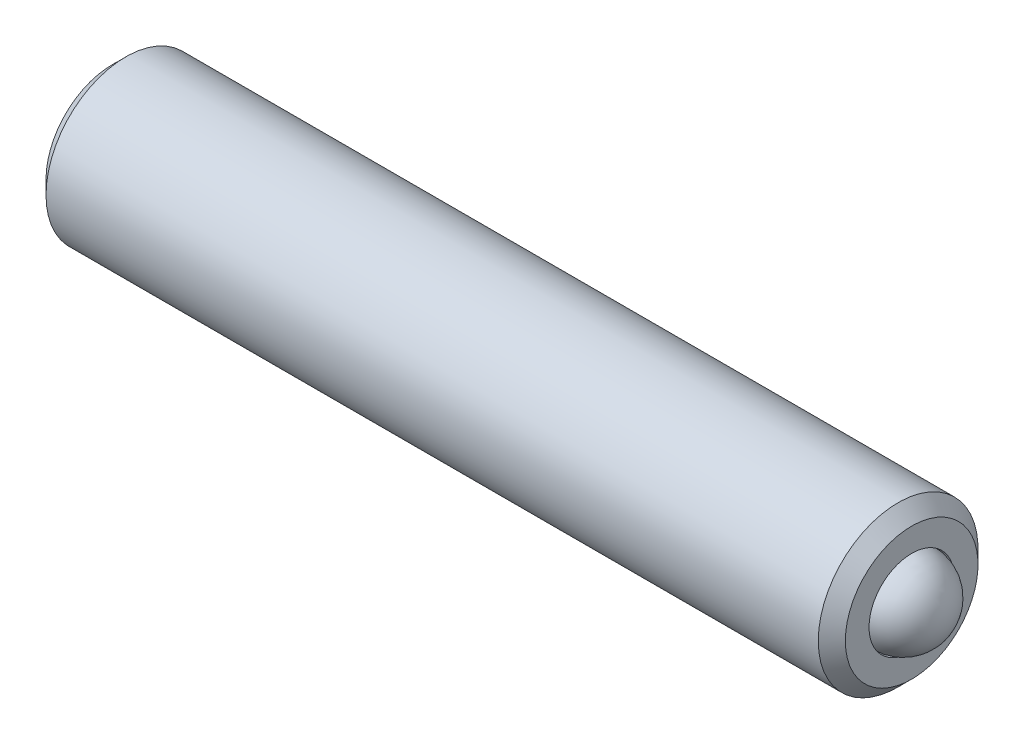
ISO-10303-21;
HEADER;
FILE_DESCRIPTION(('STEP AP214'),'2;1');
FILE_NAME('part.step','',(''),(''),'','','');
FILE_SCHEMA(('AUTOMOTIVE_DESIGN { 1 0 10303 214 1 1 1 1 }'));
ENDSEC;
DATA;
#1=APPLICATION_CONTEXT('core data for automotive mechanical design processes');
#2=APPLICATION_PROTOCOL_DEFINITION('international standard','automotive_design',2000,#1);
#3=PRODUCT_CONTEXT('',#1,'mechanical');
#4=PRODUCT('Part','Part','',(#3));
#5=PRODUCT_RELATED_PRODUCT_CATEGORY('part','',(#4));
#6=PRODUCT_DEFINITION_FORMATION('','',#4);
#7=PRODUCT_DEFINITION_CONTEXT('part definition',#1,'design');
#8=PRODUCT_DEFINITION('design','',#6,#7);
#9=PRODUCT_DEFINITION_SHAPE('','',#8);
#10=(LENGTH_UNIT() NAMED_UNIT(*) SI_UNIT(.MILLI.,.METRE.));
#11=(NAMED_UNIT(*) PLANE_ANGLE_UNIT() SI_UNIT($,.RADIAN.));
#12=(NAMED_UNIT(*) SI_UNIT($,.STERADIAN.) SOLID_ANGLE_UNIT());
#13=UNCERTAINTY_MEASURE_WITH_UNIT(LENGTH_MEASURE(1.E-05),#10,'distance_accuracy_value','');
#14=(GEOMETRIC_REPRESENTATION_CONTEXT(3) GLOBAL_UNCERTAINTY_ASSIGNED_CONTEXT((#13)) GLOBAL_UNIT_ASSIGNED_CONTEXT((#10,
#11,#12)) REPRESENTATION_CONTEXT('',''));
#15=CARTESIAN_POINT('',(0.,0.,0.));
#16=DIRECTION('',(0.,0.,1.));
#17=DIRECTION('',(1.,0.,0.));
#18=AXIS2_PLACEMENT_3D('',#15,#16,#17);
#19=CARTESIAN_POINT('',(-50.8492280408344,6.68988555515205,9.65462218806579));
#20=DIRECTION('',(-1.,0.,0.));
#21=DIRECTION('',(0.,0.,1.));
#22=AXIS2_PLACEMENT_3D('',#19,#20,#21);
#23=PLANE('',#22);
#24=CARTESIAN_POINT('',(-50.8492280408344,19.2129242950614,9.6546221880658));
#25=DIRECTION('',(-1.,0.,0.));
#26=DIRECTION('',(0.,0.,1.));
#27=AXIS2_PLACEMENT_3D('',#24,#25,#26);
#28=CIRCLE('',#27,0.952499999999967);
#29=CARTESIAN_POINT('',(-50.8492280408344,19.2129242950614,10.6071221880658));
#30=VERTEX_POINT('',#29);
#31=EDGE_CURVE('P0_E209',#30,#30,#28,.T.);
#32=ORIENTED_EDGE('',*,*,#31,.F.);
#33=EDGE_LOOP('',(#32));
#34=FACE_BOUND('',#33,.T.);
#35=CARTESIAN_POINT('',(-50.8492280408344,19.2129242950614,9.65462218806579));
#36=DIRECTION('',(-1.,0.,0.));
#37=DIRECTION('',(0.,0.,1.));
#38=AXIS2_PLACEMENT_3D('',#35,#36,#37);
#39=CIRCLE('',#38,1.24460000000001);
#40=CARTESIAN_POINT('',(-50.8492280408344,19.2129242950614,10.8992221880658));
#41=VERTEX_POINT('',#40);
#42=EDGE_CURVE('P0_E102',#41,#41,#39,.T.);
#43=ORIENTED_EDGE('',*,*,#42,.T.);
#44=EDGE_LOOP('',(#43));
#45=FACE_BOUND('',#44,.T.);
#46=ADVANCED_FACE('P0_F17',(#34,#45),#23,.T.);
#47=CARTESIAN_POINT('',(-37.131810055968,19.2129242950614,9.65462218806579));
#48=DIRECTION('',(1.,0.,0.));
#49=DIRECTION('',(0.,0.,-1.));
#50=AXIS2_PLACEMENT_3D('',#47,#48,#49);
#51=CONICAL_SURFACE('',#50,0.,0.785398163397462);
#52=CARTESIAN_POINT('',(-36.331710055968,19.2129242950614,9.65462218806579));
#53=DIRECTION('',(-1.,0.,0.));
#54=DIRECTION('',(0.,0.,1.));
#55=AXIS2_PLACEMENT_3D('',#52,#53,#54);
#56=CIRCLE('',#55,0.800100000000012);
#57=CARTESIAN_POINT('',(-36.331710055968,19.2129242950614,10.4547221880658));
#58=VERTEX_POINT('',#57);
#59=EDGE_CURVE('P0_E29',#58,#58,#56,.T.);
#60=ORIENTED_EDGE('',*,*,#59,.F.);
#61=EDGE_LOOP('',(#60));
#62=FACE_BOUND('',#61,.T.);
#63=CARTESIAN_POINT('',(-37.131810055968,19.2129242950614,9.65462218806579));
#64=VERTEX_POINT('',#63);
#65=VERTEX_LOOP('',#64);
#66=FACE_BOUND('',#65,.T.);
#67=ADVANCED_FACE('P0_F121',(#62,#66),#51,.F.);
#68=CARTESIAN_POINT('',(-50.8492280408344,19.2129242950614,9.65462218806579));
#69=DIRECTION('',(-1.,0.,0.));
#70=DIRECTION('',(0.,0.,1.));
#71=AXIS2_PLACEMENT_3D('',#68,#69,#70);
#72=CYLINDRICAL_SURFACE('',#71,0.800100000000026);
#73=CARTESIAN_POINT('',(-35.8505280408344,19.2129242950614,9.65462218806579));
#74=DIRECTION('',(-1.,0.,0.));
#75=DIRECTION('',(0.,0.,1.));
#76=AXIS2_PLACEMENT_3D('',#73,#74,#75);
#77=CIRCLE('',#76,0.800100000000039);
#78=CARTESIAN_POINT('',(-35.8505280408344,19.2129242950614,10.4547221880658));
#79=VERTEX_POINT('',#78);
#80=EDGE_CURVE('P0_E114',#79,#79,#77,.T.);
#81=ORIENTED_EDGE('',*,*,#80,.F.);
#82=EDGE_LOOP('',(#81));
#83=FACE_BOUND('',#82,.T.);
#84=ORIENTED_EDGE('',*,*,#59,.T.);
#85=EDGE_LOOP('',(#84));
#86=FACE_BOUND('',#85,.T.);
#87=ADVANCED_FACE('P0_F119',(#83,#86),#72,.F.);
#88=CARTESIAN_POINT('',(-35.8505280408344,6.68988555515184,9.65462218806579));
#89=DIRECTION('',(-1.,0.,0.));
#90=DIRECTION('',(0.,0.,1.));
#91=AXIS2_PLACEMENT_3D('',#88,#89,#90);
#92=PLANE('',#91);
#93=CARTESIAN_POINT('',(-35.8505280408343,19.2129242950614,9.65462218806579));
#94=DIRECTION('',(-1.,0.,0.));
#95=DIRECTION('',(0.,0.,1.));
#96=AXIS2_PLACEMENT_3D('',#93,#94,#95);
#97=CIRCLE('',#96,1.24460000000001);
#98=CARTESIAN_POINT('',(-35.8505280408343,19.2129242950614,10.8992221880658));
#99=VERTEX_POINT('',#98);
#100=EDGE_CURVE('P0_E111',#99,#99,#97,.T.);
#101=ORIENTED_EDGE('',*,*,#100,.F.);
#102=EDGE_LOOP('',(#101));
#103=FACE_BOUND('',#102,.T.);
#104=ORIENTED_EDGE('',*,*,#80,.T.);
#105=EDGE_LOOP('',(#104));
#106=FACE_BOUND('',#105,.T.);
#107=ADVANCED_FACE('P0_F128',(#103,#106),#92,.F.);
#108=CARTESIAN_POINT('',(-35.8505280408343,19.2129242950614,9.65462218806579));
#109=DIRECTION('',(-1.,0.,0.));
#110=DIRECTION('',(0.,0.,1.));
#111=AXIS2_PLACEMENT_3D('',#108,#109,#110);
#112=CONICAL_SURFACE('',#111,1.24460000000001,0.785398163397391);
#113=CARTESIAN_POINT('',(-36.1045280408344,19.2129242950614,9.65462218806579));
#114=DIRECTION('',(-1.,0.,0.));
#115=DIRECTION('',(0.,0.,1.));
#116=AXIS2_PLACEMENT_3D('',#113,#114,#115);
#117=CIRCLE('',#116,1.4986);
#118=CARTESIAN_POINT('',(-36.1045280408344,19.2129242950614,11.1532221880658));
#119=VERTEX_POINT('',#118);
#120=EDGE_CURVE('P0_E108',#119,#119,#117,.T.);
#121=ORIENTED_EDGE('',*,*,#120,.F.);
#122=EDGE_LOOP('',(#121));
#123=FACE_BOUND('',#122,.T.);
#124=ORIENTED_EDGE('',*,*,#100,.T.);
#125=EDGE_LOOP('',(#124));
#126=FACE_BOUND('',#125,.T.);
#127=ADVANCED_FACE('P0_F135',(#123,#126),#112,.T.);
#128=CARTESIAN_POINT('',(-50.8492280408344,19.2129242950614,9.65462218806579));
#129=DIRECTION('',(-1.,0.,0.));
#130=DIRECTION('',(0.,0.,1.));
#131=AXIS2_PLACEMENT_3D('',#128,#129,#130);
#132=CYLINDRICAL_SURFACE('',#131,1.4986);
#133=CARTESIAN_POINT('',(-50.5952280408344,19.2129242950614,9.65462218806579));
#134=DIRECTION('',(-1.,0.,0.));
#135=DIRECTION('',(0.,0.,1.));
#136=AXIS2_PLACEMENT_3D('',#133,#134,#135);
#137=CIRCLE('',#136,1.49859999999999);
#138=CARTESIAN_POINT('',(-50.5952280408344,19.2129242950614,11.1532221880658));
#139=VERTEX_POINT('',#138);
#140=EDGE_CURVE('P0_E105',#139,#139,#137,.T.);
#141=ORIENTED_EDGE('',*,*,#140,.F.);
#142=EDGE_LOOP('',(#141));
#143=FACE_BOUND('',#142,.T.);
#144=ORIENTED_EDGE('',*,*,#120,.T.);
#145=EDGE_LOOP('',(#144));
#146=FACE_BOUND('',#145,.T.);
#147=ADVANCED_FACE('P0_F139',(#143,#146),#132,.T.);
#148=CARTESIAN_POINT('',(-50.8492280408344,19.2129242950614,9.65462218806579));
#149=DIRECTION('',(1.,0.,0.));
#150=DIRECTION('',(0.,0.,-1.));
#151=AXIS2_PLACEMENT_3D('',#148,#149,#150);
#152=CONICAL_SURFACE('',#151,1.24460000000001,0.785398163397408);
#153=ORIENTED_EDGE('',*,*,#140,.T.);
#154=EDGE_LOOP('',(#153));
#155=FACE_BOUND('',#154,.T.);
#156=ORIENTED_EDGE('',*,*,#42,.F.);
#157=EDGE_LOOP('',(#156));
#158=FACE_BOUND('',#157,.T.);
#159=ADVANCED_FACE('P0_F143',(#155,#158),#152,.T.);
#160=CARTESIAN_POINT('',(-50.8492280408344,19.2129242950614,9.6546221880658));
#161=DIRECTION('',(-1.,0.,0.));
#162=DIRECTION('',(0.,0.,1.));
#163=AXIS2_PLACEMENT_3D('',#160,#161,#162);
#164=CONICAL_SURFACE('',#163,0.952499999999967,0.78539816339745);
#165=ORIENTED_EDGE('',*,*,#31,.T.);
#166=EDGE_LOOP('',(#165));
#167=FACE_BOUND('',#166,.T.);
#168=CARTESIAN_POINT('',(-50.6461435375757,19.9623397651152,9.6548221880658));
#169=CARTESIAN_POINT('',(-50.6332669544786,19.9494553235606,9.63250568066609));
#170=CARTESIAN_POINT('',(-50.6211450346126,19.9363562535594,9.60981742589206));
#171=CARTESIAN_POINT('',(-50.5989492701165,19.9096454909543,9.56355302795113));
#172=CARTESIAN_POINT('',(-50.5888877875176,19.8960312533826,9.53997247677069));
#173=CARTESIAN_POINT('',(-50.5716542178505,19.8685769960101,9.49242030811735));
#174=CARTESIAN_POINT('',(-50.564438733747,19.85474400778,9.46846086968234));
#175=CARTESIAN_POINT('',(-50.5533125939582,19.8267800777349,9.42002592206498));
#176=CARTESIAN_POINT('',(-50.5493936513459,19.8126499751233,9.39555186642545));
#177=CARTESIAN_POINT('',(-50.5444217062835,19.7781360728176,9.33577203406448));
#178=CARTESIAN_POINT('',(-50.5453212424714,19.75767165652,9.30032662528982));
#179=CARTESIAN_POINT('',(-50.5545897838917,19.717171781506,9.23017878406545));
#180=CARTESIAN_POINT('',(-50.562969943118,19.6971370091074,9.19547754035296));
#181=CARTESIAN_POINT('',(-50.5831790195046,19.6619519543163,9.13453523778766));
#182=CARTESIAN_POINT('',(-50.5939537424295,19.6466399138503,9.10801400573294));
#183=CARTESIAN_POINT('',(-50.6182266563963,19.6166157969289,9.0560107097727));
#184=CARTESIAN_POINT('',(-50.6317159883813,19.6019019513419,9.03052558164131));
#185=CARTESIAN_POINT('',(-50.6461435375757,19.5874588250076,9.00550935301011));
#186=B_SPLINE_CURVE_WITH_KNOTS('',3,(#168,#169,#170,#171,#172,#173,#174,#175,#176,#177,#178,
#179,#180,#181,#182,#183,#184,#185),.UNSPECIFIED.,.F.,.F.,(4,2,2,2,2,2,2,2,4),(0.,
0.0864788641253363,0.173462284806168,0.259062693136961,0.344447268473232,0.466486555643646,
0.588708114182827,0.68596269286373,0.78290488582614),.UNSPECIFIED.);
#187=CARTESIAN_POINT('',(-50.6460280408344,19.9622242950614,9.6546221880658));
#188=VERTEX_POINT('',#187);
#189=CARTESIAN_POINT('',(-50.6460280408344,19.5875742950614,9.00570935301011));
#190=VERTEX_POINT('',#189);
#191=EDGE_CURVE('P0_E86',#188,#190,#186,.T.);
#192=ORIENTED_EDGE('',*,*,#191,.F.);
#193=CARTESIAN_POINT('',(-50.6461435375757,19.9623397651152,9.6544221880658));
#194=CARTESIAN_POINT('',(-50.6332669544786,19.9494553235606,9.67673869546551));
#195=CARTESIAN_POINT('',(-50.6211450346126,19.9363562535594,9.69942695023954));
#196=CARTESIAN_POINT('',(-50.5989492701165,19.9096454909543,9.74569134818047));
#197=CARTESIAN_POINT('',(-50.5888877875176,19.8960312533826,9.76927189936091));
#198=CARTESIAN_POINT('',(-50.5716542178505,19.8685769960101,9.81682406801425));
#199=CARTESIAN_POINT('',(-50.564438733747,19.85474400778,9.84078350644925));
#200=CARTESIAN_POINT('',(-50.5533125939582,19.8267800777349,9.88921845406662));
#201=CARTESIAN_POINT('',(-50.5493936513459,19.8126499751233,9.91369250970615));
#202=CARTESIAN_POINT('',(-50.5444217062835,19.7781360728176,9.97347234206712));
#203=CARTESIAN_POINT('',(-50.5453212424714,19.75767165652,10.0089177508418));
#204=CARTESIAN_POINT('',(-50.5545897838917,19.717171781506,10.0790655920662));
#205=CARTESIAN_POINT('',(-50.562969943118,19.6971370091074,10.1137668357786));
#206=CARTESIAN_POINT('',(-50.5831790195046,19.6619519543163,10.1747091383439));
#207=CARTESIAN_POINT('',(-50.5939537424295,19.6466399138503,10.2012303703986));
#208=CARTESIAN_POINT('',(-50.6182266563963,19.6166157969289,10.2532336663589));
#209=CARTESIAN_POINT('',(-50.6317159883813,19.6019019513419,10.2787187944903));
#210=CARTESIAN_POINT('',(-50.6461435375757,19.5874588250076,10.3037350231215));
#211=B_SPLINE_CURVE_WITH_KNOTS('',3,(#193,#194,#195,#196,#197,#198,#199,#200,#201,#202,#203,
#204,#205,#206,#207,#208,#209,#210),.UNSPECIFIED.,.F.,.F.,(4,2,2,2,2,2,2,2,4),(0.,
0.0864788641253363,0.173462284806164,0.259062693136952,0.344447268473231,0.466486555643645,
0.588708114182826,0.685962692863699,0.782904885826084),.UNSPECIFIED.);
#212=CARTESIAN_POINT('',(-50.6460280408344,19.5875742950614,10.3035350231215));
#213=VERTEX_POINT('',#212);
#214=EDGE_CURVE('P0_E185',#188,#213,#211,.T.);
#215=ORIENTED_EDGE('',*,*,#214,.T.);
#216=CARTESIAN_POINT('',(-52.3582672597763,16.8384585743382,10.3035350231214));
#217=CARTESIAN_POINT('',(-52.3005248184635,16.8983236608722,10.3035350231214));
#218=CARTESIAN_POINT('',(-52.2428558846747,16.9582599817461,10.3035350231214));
#219=CARTESIAN_POINT('',(-52.1277140621493,17.0783267267323,10.3035350231214));
#220=CARTESIAN_POINT('',(-52.0702411840464,17.1384571610392,10.3035350231214));
#221=CARTESIAN_POINT('',(-51.9553874274638,17.2591246989136,10.3035350231214));
#222=CARTESIAN_POINT('',(-51.8980072476852,17.3196624680924,10.3035350231214));
#223=CARTESIAN_POINT('',(-51.7835818929589,17.4410493968345,10.3035350231214));
#224=CARTESIAN_POINT('',(-51.7265367043378,17.5018985434956,10.3035350231214));
#225=CARTESIAN_POINT('',(-51.6057517318865,17.6316876956167,10.3035350231214));
#226=CARTESIAN_POINT('',(-51.5420716794448,17.70068336987,10.3035350231214));
#227=CARTESIAN_POINT('',(-51.415524266655,17.8394366097933,10.3035350231214));
#228=CARTESIAN_POINT('',(-51.3526570190744,17.9091942787562,10.3035350231214));
#229=CARTESIAN_POINT('',(-51.2282956128797,18.049715814669,10.3035350231214));
#230=CARTESIAN_POINT('',(-51.1667993188585,18.1204777878539,10.3035350231214));
#231=CARTESIAN_POINT('',(-51.0458742541531,18.2637386653362,10.3035350231214));
#232=CARTESIAN_POINT('',(-50.9864448576677,18.3362370324737,10.3035350231214));
#233=CARTESIAN_POINT('',(-50.8941427467821,18.4549489858022,10.3035350231214));
#234=CARTESIAN_POINT('',(-50.8600628807907,18.5002179064351,10.3035350231214));
#235=CARTESIAN_POINT('',(-50.793993741084,18.5924079199968,10.3035350231214));
#236=CARTESIAN_POINT('',(-50.7620084081889,18.6393318854079,10.3035350231214));
#237=CARTESIAN_POINT('',(-50.7021553148581,18.734417449365,10.3035350231214));
#238=CARTESIAN_POINT('',(-50.6742159663038,18.7825332543751,10.3035350231214));
#239=CARTESIAN_POINT('',(-50.6240791803403,18.88161381957,10.3035350231214));
#240=CARTESIAN_POINT('',(-50.6018597073632,18.9325666978299,10.3035350231214));
#241=CARTESIAN_POINT('',(-50.5737664350338,19.0174446302383,10.3035350231214));
#242=CARTESIAN_POINT('',(-50.5648938568847,19.0503495839798,10.3035350231214));
#243=CARTESIAN_POINT('',(-50.5518762581693,19.1170254606582,10.3035350231214));
#244=CARTESIAN_POINT('',(-50.5477183138756,19.150793755564,10.3035350231214));
#245=CARTESIAN_POINT('',(-50.5444624635168,19.226203247837,10.3035350231214));
#246=CARTESIAN_POINT('',(-50.5467090548792,19.2679110777235,10.3035350231214));
#247=CARTESIAN_POINT('',(-50.5587549291686,19.3503263367743,10.3035350231214));
#248=CARTESIAN_POINT('',(-50.5685873595642,19.3910285641315,10.3035350231214));
#249=CARTESIAN_POINT('',(-50.5912818196157,19.4623603771279,10.3035350231214));
#250=CARTESIAN_POINT('',(-50.6031052209592,19.4933402533904,10.3035350231214));
#251=CARTESIAN_POINT('',(-50.6293857296264,19.5541753585139,10.3035350231214));
#252=CARTESIAN_POINT('',(-50.6438450054584,19.5840296367694,10.3035350231214));
#253=CARTESIAN_POINT('',(-50.674821082072,19.6430144114392,10.3035350231215));
#254=CARTESIAN_POINT('',(-50.6913569889331,19.6721347019612,10.3035350231215));
#255=CARTESIAN_POINT('',(-50.725835053014,19.7295043368302,10.3035350231215));
#256=CARTESIAN_POINT('',(-50.7437765881965,19.7577540588069,10.3035350231215));
#257=CARTESIAN_POINT('',(-50.7856302604539,19.8210063289774,10.3035350231215));
#258=CARTESIAN_POINT('',(-50.8098578928856,19.8557988616734,10.3035350231215));
#259=CARTESIAN_POINT('',(-50.8594933521178,19.924535310787,10.3035350231215));
#260=CARTESIAN_POINT('',(-50.8849014445484,19.958479033534,10.3035350231215));
#261=CARTESIAN_POINT('',(-50.9624264420727,20.0593879807787,10.3035350231215));
#262=CARTESIAN_POINT('',(-51.0158076126297,20.1253782669672,10.3035350231215));
#263=CARTESIAN_POINT('',(-51.1246440881747,20.2559847894286,10.3035350231215));
#264=CARTESIAN_POINT('',(-51.1801059031482,20.3205955109384,10.3035350231215));
#265=CARTESIAN_POINT('',(-51.2922045642701,20.4487353923309,10.3035350231215));
#266=CARTESIAN_POINT('',(-51.3488408644773,20.5122650307978,10.3035350231215));
#267=CARTESIAN_POINT('',(-51.4565972583726,20.6316149197107,10.3035350231215));
#268=CARTESIAN_POINT('',(-51.5076343575766,20.6875104474987,10.3035350231215));
#269=CARTESIAN_POINT('',(-51.6101732899424,20.7988874174632,10.3035350231215));
#270=CARTESIAN_POINT('',(-51.6616751858445,20.8543688018325,10.3035350231215));
#271=CARTESIAN_POINT('',(-51.7646749123315,20.9646446043097,10.3035350231215));
#272=CARTESIAN_POINT('',(-51.816170483131,21.0194411365141,10.3035350231215));
#273=CARTESIAN_POINT('',(-51.9194156065366,21.1287773349842,10.3035350231215));
#274=CARTESIAN_POINT('',(-51.9711651156316,21.1833170423189,10.3035350231215));
#275=CARTESIAN_POINT('',(-52.0230092694508,21.2377660162008,10.3035350231215));
#276=B_SPLINE_CURVE_WITH_KNOTS('',3,(#216,#217,#218,#219,#220,#221,#222,#223,#224,#225,#226,
#227,#228,#229,#230,#231,#232,#233,#234,#235,#236,#237,#238,#239,#240,#241,#242,#243,#244,#245,
#246,#247,#248,#249,#250,#251,#252,#253,#254,#255,#256,#257,#258,#259,#260,#261,#262,#263,#264,
#265,#266,#267,#268,#269,#270,#271,#272,#273,#274,#275),.UNSPECIFIED.,.F.,.F.,(4,2,2,2,2,2,2,2,
2,2,2,2,2,2,2,2,2,2,2,2,2,2,2,2,2,2,2,2,2,4),(0.,0.249524169444004,0.499061664048885,
0.749292126030595,0.999512302282445,1.28118188446101,1.56289013456249,1.84412364646024,
2.12527125365798,2.29522422452389,2.46548827885776,2.63222422359155,2.79830787351782,
2.90027530295199,3.00196253895402,3.12646325295113,3.25151109444012,3.3508471107282,
3.45026522165705,3.55067620712116,3.65104300569414,3.77819720424592,3.90538015527483,
4.15993807573804,4.41537266799765,4.67069107504104,4.89776066228875,5.12486137303339,
5.35044877312651,5.57599878315942),.UNSPECIFIED.);
#277=CARTESIAN_POINT('',(-50.6460280408344,18.8382742950614,10.3035350231214));
#278=VERTEX_POINT('',#277);
#279=EDGE_CURVE('P0_E180',#213,#278,#276,.F.);
#280=ORIENTED_EDGE('',*,*,#279,.T.);
#281=CARTESIAN_POINT('',(-50.6461435375757,18.8383897651152,10.3037350231214));
#282=CARTESIAN_POINT('',(-50.6332669544785,18.8255053235606,10.2814185157217));
#283=CARTESIAN_POINT('',(-50.6211450346126,18.8124062535594,10.2587302609477));
#284=CARTESIAN_POINT('',(-50.5989492701165,18.7856954909543,10.2124658630068));
#285=CARTESIAN_POINT('',(-50.5888877875175,18.7720812533826,10.1888853118263));
#286=CARTESIAN_POINT('',(-50.5716542178505,18.7446269960101,10.141333143173));
#287=CARTESIAN_POINT('',(-50.564438733747,18.73079400778,10.117373704738));
#288=CARTESIAN_POINT('',(-50.5533125939582,18.7028300777349,10.0689387571206));
#289=CARTESIAN_POINT('',(-50.5493936513459,18.6886999751233,10.0444647014811));
#290=CARTESIAN_POINT('',(-50.5444217062835,18.6541860728176,9.98468486912015));
#291=CARTESIAN_POINT('',(-50.5453212424714,18.63372165652,9.94923946034549));
#292=CARTESIAN_POINT('',(-50.5545897838917,18.593221781506,9.87909161912112));
#293=CARTESIAN_POINT('',(-50.562969943118,18.5731870091074,9.84439037540864));
#294=CARTESIAN_POINT('',(-50.5831790195046,18.5380019543163,9.78344807284333));
#295=CARTESIAN_POINT('',(-50.5939537424295,18.5226899138503,9.75692684078862));
#296=CARTESIAN_POINT('',(-50.6182266563963,18.4926657969289,9.70492354482838));
#297=CARTESIAN_POINT('',(-50.6317159883813,18.4779519513419,9.67943841669699));
#298=CARTESIAN_POINT('',(-50.6461435375757,18.4635088250075,9.65442218806579));
#299=B_SPLINE_CURVE_WITH_KNOTS('',3,(#281,#282,#283,#284,#285,#286,#287,#288,#289,#290,#291,
#292,#293,#294,#295,#296,#297,#298),.UNSPECIFIED.,.F.,.F.,(4,2,2,2,2,2,2,2,4),(0.,
0.0864788641253178,0.173462284806133,0.259062693136907,0.344447268473169,0.466486555643585,
0.588708114182759,0.685962692863657,0.782904885826072),.UNSPECIFIED.);
#300=CARTESIAN_POINT('',(-50.6460280408344,18.4636242950614,9.65462218806579));
#301=VERTEX_POINT('',#300);
#302=EDGE_CURVE('P0_E36',#278,#301,#299,.T.);
#303=ORIENTED_EDGE('',*,*,#302,.T.);
#304=CARTESIAN_POINT('',(-50.6461435375757,18.8383897651152,9.00550935301011));
#305=CARTESIAN_POINT('',(-50.6332669544786,18.8255053235606,9.02782586040982));
#306=CARTESIAN_POINT('',(-50.6211450346126,18.8124062535594,9.05051411518386));
#307=CARTESIAN_POINT('',(-50.5989492701166,18.7856954909543,9.09677851312478));
#308=CARTESIAN_POINT('',(-50.5888877875176,18.7720812533826,9.12035906430522));
#309=CARTESIAN_POINT('',(-50.5716542178505,18.7446269960101,9.16791123295856));
#310=CARTESIAN_POINT('',(-50.564438733747,18.73079400778,9.19187067139356));
#311=CARTESIAN_POINT('',(-50.5533125939582,18.7028300777349,9.24030561901093));
#312=CARTESIAN_POINT('',(-50.5493936513459,18.6886999751233,9.26477967465046));
#313=CARTESIAN_POINT('',(-50.5444217062835,18.6541860728176,9.32455950701143));
#314=CARTESIAN_POINT('',(-50.5453212424714,18.63372165652,9.36000491578609));
#315=CARTESIAN_POINT('',(-50.5545897838917,18.593221781506,9.43015275701046));
#316=CARTESIAN_POINT('',(-50.562969943118,18.5731870091074,9.46485400072295));
#317=CARTESIAN_POINT('',(-50.5831790195046,18.5380019543163,9.52579630328825));
#318=CARTESIAN_POINT('',(-50.5939537424295,18.5226899138503,9.55231753534296));
#319=CARTESIAN_POINT('',(-50.6182266563963,18.4926657969289,9.6043208313032));
#320=CARTESIAN_POINT('',(-50.6317159883813,18.4779519513419,9.62980595943459));
#321=CARTESIAN_POINT('',(-50.6461435375757,18.4635088250075,9.65482218806579));
#322=B_SPLINE_CURVE_WITH_KNOTS('',3,(#304,#305,#306,#307,#308,#309,#310,#311,#312,#313,#314,
#315,#316,#317,#318,#319,#320,#321),.UNSPECIFIED.,.F.,.F.,(4,2,2,2,2,2,2,2,4),(0.,
0.086478864125342,0.173462284806171,0.259062693136955,0.344447268473237,0.466486555643653,
0.588708114182834,0.685962692863721,0.782904885826126),.UNSPECIFIED.);
#323=CARTESIAN_POINT('',(-50.6460280408344,18.8382742950614,9.00570935301011));
#324=VERTEX_POINT('',#323);
#325=EDGE_CURVE('P0_E11',#324,#301,#322,.T.);
#326=ORIENTED_EDGE('',*,*,#325,.F.);
#327=CARTESIAN_POINT('',(-52.3582672597763,16.8384585743382,9.00570935301011));
#328=CARTESIAN_POINT('',(-52.3005248184635,16.8983236608722,9.00570935301011));
#329=CARTESIAN_POINT('',(-52.2428558846747,16.9582599817461,9.00570935301011));
#330=CARTESIAN_POINT('',(-52.1277140621493,17.0783267267324,9.00570935301011));
#331=CARTESIAN_POINT('',(-52.0702411840464,17.1384571610392,9.00570935301011));
#332=CARTESIAN_POINT('',(-51.9553874274638,17.2591246989136,9.00570935301011));
#333=CARTESIAN_POINT('',(-51.8980072476852,17.3196624680925,9.00570935301011));
#334=CARTESIAN_POINT('',(-51.7835818929589,17.4410493968345,9.00570935301011));
#335=CARTESIAN_POINT('',(-51.7265367043378,17.5018985434956,9.00570935301011));
#336=CARTESIAN_POINT('',(-51.6057517318866,17.6316876956167,9.00570935301011));
#337=CARTESIAN_POINT('',(-51.5420716794448,17.70068336987,9.00570935301011));
#338=CARTESIAN_POINT('',(-51.415524266655,17.8394366097932,9.00570935301011));
#339=CARTESIAN_POINT('',(-51.3526570190745,17.9091942787562,9.00570935301011));
#340=CARTESIAN_POINT('',(-51.2282956128798,18.0497158146689,9.00570935301011));
#341=CARTESIAN_POINT('',(-51.1667993188586,18.1204777878538,9.00570935301011));
#342=CARTESIAN_POINT('',(-51.0458742541532,18.2637386653361,9.00570935301011));
#343=CARTESIAN_POINT('',(-50.9864448576678,18.3362370324736,9.00570935301011));
#344=CARTESIAN_POINT('',(-50.8941427467822,18.4549489858021,9.00570935301011));
#345=CARTESIAN_POINT('',(-50.8600628807908,18.5002179064351,9.00570935301011));
#346=CARTESIAN_POINT('',(-50.793993741084,18.5924079199967,9.00570935301011));
#347=CARTESIAN_POINT('',(-50.7620084081889,18.6393318854079,9.00570935301011));
#348=CARTESIAN_POINT('',(-50.7021553148582,18.734417449365,9.00570935301011));
#349=CARTESIAN_POINT('',(-50.6742159663039,18.7825332543751,9.00570935301011));
#350=CARTESIAN_POINT('',(-50.6240791803404,18.88161381957,9.00570935301011));
#351=CARTESIAN_POINT('',(-50.6018597073633,18.9325666978299,9.00570935301011));
#352=CARTESIAN_POINT('',(-50.5737664350339,19.0174446302384,9.00570935301011));
#353=CARTESIAN_POINT('',(-50.5648938568848,19.0503495839798,9.00570935301011));
#354=CARTESIAN_POINT('',(-50.5518762581694,19.1170254606582,9.00570935301011));
#355=CARTESIAN_POINT('',(-50.5477183138756,19.150793755564,9.00570935301011));
#356=CARTESIAN_POINT('',(-50.5444624635169,19.226203247837,9.00570935301011));
#357=CARTESIAN_POINT('',(-50.5467090548793,19.2679110777235,9.00570935301011));
#358=CARTESIAN_POINT('',(-50.5587549291687,19.3503263367743,9.00570935301011));
#359=CARTESIAN_POINT('',(-50.5685873595643,19.3910285641315,9.00570935301011));
#360=CARTESIAN_POINT('',(-50.5912818196158,19.462360377128,9.00570935301011));
#361=CARTESIAN_POINT('',(-50.6031052209593,19.4933402533904,9.00570935301011));
#362=CARTESIAN_POINT('',(-50.6293857296265,19.554175358514,9.00570935301011));
#363=CARTESIAN_POINT('',(-50.6438450054585,19.5840296367695,9.00570935301011));
#364=CARTESIAN_POINT('',(-50.6748210820721,19.6430144114393,9.00570935301011));
#365=CARTESIAN_POINT('',(-50.6913569889332,19.6721347019613,9.00570935301011));
#366=CARTESIAN_POINT('',(-50.725835053014,19.7295043368303,9.00570935301011));
#367=CARTESIAN_POINT('',(-50.7437765881966,19.757754058807,9.00570935301011));
#368=CARTESIAN_POINT('',(-50.785630260454,19.8210063289775,9.00570935301011));
#369=CARTESIAN_POINT('',(-50.8098578928857,19.8557988616735,9.00570935301011));
#370=CARTESIAN_POINT('',(-50.8594933521179,19.9245353107871,9.00570935301011));
#371=CARTESIAN_POINT('',(-50.8849014445485,19.9584790335341,9.00570935301011));
#372=CARTESIAN_POINT('',(-50.9624264420728,20.0593879807788,9.00570935301011));
#373=CARTESIAN_POINT('',(-51.0158076126298,20.1253782669673,9.00570935301011));
#374=CARTESIAN_POINT('',(-51.1246440881748,20.2559847894288,9.00570935301011));
#375=CARTESIAN_POINT('',(-51.1801059031483,20.3205955109386,9.00570935301011));
#376=CARTESIAN_POINT('',(-51.2922045642702,20.4487353923311,9.00570935301011));
#377=CARTESIAN_POINT('',(-51.3488408644775,20.512265030798,9.00570935301011));
#378=CARTESIAN_POINT('',(-51.4565972583728,20.6316149197109,9.00570935301011));
#379=CARTESIAN_POINT('',(-51.5076343575768,20.6875104474989,9.00570935301011));
#380=CARTESIAN_POINT('',(-51.6101732899426,20.7988874174634,9.00570935301011));
#381=CARTESIAN_POINT('',(-51.6616751858448,20.8543688018327,9.00570935301011));
#382=CARTESIAN_POINT('',(-51.7646749123317,20.96464460431,9.00570935301011));
#383=CARTESIAN_POINT('',(-51.8161704831313,21.0194411365144,9.00570935301011));
#384=CARTESIAN_POINT('',(-51.9194156065368,21.1287773349845,9.00570935301011));
#385=CARTESIAN_POINT('',(-51.9711651156318,21.1833170423192,9.00570935301011));
#386=CARTESIAN_POINT('',(-52.0230092694511,21.2377660162011,9.00570935301011));
#387=B_SPLINE_CURVE_WITH_KNOTS('',3,(#327,#328,#329,#330,#331,#332,#333,#334,#335,#336,#337,
#338,#339,#340,#341,#342,#343,#344,#345,#346,#347,#348,#349,#350,#351,#352,#353,#354,#355,#356,
#357,#358,#359,#360,#361,#362,#363,#364,#365,#366,#367,#368,#369,#370,#371,#372,#373,#374,#375,
#376,#377,#378,#379,#380,#381,#382,#383,#384,#385,#386),.UNSPECIFIED.,.F.,.F.,(4,2,2,2,2,2,2,2,
2,2,2,2,2,2,2,2,2,2,2,2,2,2,2,2,2,2,2,2,2,4),(0.,0.249524169443994,0.499061664048865,
0.749292126030566,0.999512302282406,1.28118188446095,1.5628901345624,1.84412364646013,
2.12527125365785,2.29522422452379,2.46548827885769,2.63222422359149,2.79830787351779,
2.90027530295197,3.001962538954,3.12646325295112,3.25151109444011,3.3508471107282,
3.45026522165707,3.55067620712118,3.65104300569419,3.77819720424598,3.90538015527491,
4.15993807573815,4.4153726679978,4.67069107504122,4.89776066228896,5.12486137303364,
5.35044877312679,5.57599878315973),.UNSPECIFIED.);
#388=EDGE_CURVE('P0_E72',#190,#324,#387,.F.);
#389=ORIENTED_EDGE('',*,*,#388,.F.);
#390=EDGE_LOOP('',(#192,#215,#280,#303,#326,#389));
#391=FACE_BOUND('',#390,.T.);
#392=ADVANCED_FACE('P0_F71',(#167,#391),#164,.F.);
#393=CARTESIAN_POINT('',(-47.8012280408344,16.333382938824,9.65462218806579));
#394=DIRECTION('',(-1.,0.,0.));
#395=DIRECTION('',(0.,0.,1.));
#396=AXIS2_PLACEMENT_3D('',#393,#394,#395);
#397=PLANE('',#396);
#398=DIRECTION('',(0.,-1.,0.));
#399=VECTOR('',#398,1.);
#400=CARTESIAN_POINT('',(-47.8012280408344,16.333382938824,9.00570935301011));
#401=LINE('',#400,#399);
#402=CARTESIAN_POINT('',(-47.8012280408344,19.5875742950614,9.00570935301011));
#403=VERTEX_POINT('',#402);
#404=CARTESIAN_POINT('',(-47.8012280408344,18.8382742950614,9.00570935301011));
#405=VERTEX_POINT('',#404);
#406=EDGE_CURVE('P0_E85',#403,#405,#401,.T.);
#407=ORIENTED_EDGE('',*,*,#406,.T.);
#408=DIRECTION('',(0.,-0.5,0.866025403784439));
#409=VECTOR('',#408,1.);
#410=CARTESIAN_POINT('',(-47.8012280408344,17.931063956002,10.5770437534127));
#411=LINE('',#410,#409);
#412=CARTESIAN_POINT('',(-47.8012280408344,18.4636242950614,9.65462218806579));
#413=VERTEX_POINT('',#412);
#414=EDGE_CURVE('P0_E90',#405,#413,#411,.T.);
#415=ORIENTED_EDGE('',*,*,#414,.T.);
#416=DIRECTION('',(0.,-0.5,-0.866025403784439));
#417=VECTOR('',#416,1.);
#418=CARTESIAN_POINT('',(-47.8012280408344,17.931063956002,8.73220062271891));
#419=LINE('',#418,#417);
#420=CARTESIAN_POINT('',(-47.8012280408344,18.8382742950614,10.3035350231214));
#421=VERTEX_POINT('',#420);
#422=EDGE_CURVE('P0_E224',#421,#413,#419,.T.);
#423=ORIENTED_EDGE('',*,*,#422,.F.);
#424=DIRECTION('',(0.,-1.,0.));
#425=VECTOR('',#424,1.);
#426=CARTESIAN_POINT('',(-47.8012280408344,16.333382938824,10.3035350231213));
#427=LINE('',#426,#425);
#428=CARTESIAN_POINT('',(-47.8012280408344,19.5875742950614,10.3035350231215));
#429=VERTEX_POINT('',#428);
#430=EDGE_CURVE('P0_E214',#429,#421,#427,.T.);
#431=ORIENTED_EDGE('',*,*,#430,.F.);
#432=DIRECTION('',(0.,-0.499999999999998,0.86602540378444));
#433=VECTOR('',#432,1.);
#434=CARTESIAN_POINT('',(-47.8012280408344,19.0550139560021,11.2259565884683));
#435=LINE('',#434,#433);
#436=CARTESIAN_POINT('',(-47.8012280408344,19.9622242950614,9.6546221880658));
#437=VERTEX_POINT('',#436);
#438=EDGE_CURVE('P0_E98',#437,#429,#435,.T.);
#439=ORIENTED_EDGE('',*,*,#438,.F.);
#440=DIRECTION('',(0.,-0.499999999999997,-0.866025403784441));
#441=VECTOR('',#440,1.);
#442=CARTESIAN_POINT('',(-47.8012280408344,19.0550139560021,8.08328778766324));
#443=LINE('',#442,#441);
#444=EDGE_CURVE('P0_E93',#437,#403,#443,.T.);
#445=ORIENTED_EDGE('',*,*,#444,.T.);
#446=EDGE_LOOP('',(#407,#415,#423,#431,#439,#445));
#447=FACE_BOUND('',#446,.T.);
#448=ADVANCED_FACE('P0_F167',(#447),#397,.T.);
#449=CARTESIAN_POINT('',(-47.8012280408344,17.931063956002,10.5770437534127));
#450=DIRECTION('',(0.,-0.866025403784439,-0.5));
#451=DIRECTION('',(0.,0.5,-0.866025403784439));
#452=AXIS2_PLACEMENT_3D('',#449,#450,#451);
#453=PLANE('',#452);
#454=DIRECTION('',(-1.,0.,0.));
#455=VECTOR('',#454,1.);
#456=CARTESIAN_POINT('',(-47.8012280408344,18.8382742950614,9.00570935301011));
#457=LINE('',#456,#455);
#458=EDGE_CURVE('P0_E82',#405,#324,#457,.T.);
#459=ORIENTED_EDGE('',*,*,#458,.T.);
#460=ORIENTED_EDGE('',*,*,#325,.T.);
#461=DIRECTION('',(-1.,0.,0.));
#462=VECTOR('',#461,1.);
#463=CARTESIAN_POINT('',(-47.8012280408344,18.4636242950614,9.65462218806579));
#464=LINE('',#463,#462);
#465=EDGE_CURVE('P0_E92',#413,#301,#464,.T.);
#466=ORIENTED_EDGE('',*,*,#465,.F.);
#467=ORIENTED_EDGE('',*,*,#414,.F.);
#468=EDGE_LOOP('',(#459,#460,#466,#467));
#469=FACE_BOUND('',#468,.T.);
#470=ADVANCED_FACE('P0_F88',(#469),#453,.F.);
#471=CARTESIAN_POINT('',(-47.8012280408344,17.931063956002,8.73220062271891));
#472=DIRECTION('',(0.,0.866025403784439,-0.5));
#473=DIRECTION('',(0.,0.5,0.866025403784439));
#474=AXIS2_PLACEMENT_3D('',#471,#472,#473);
#475=PLANE('',#474);
#476=ORIENTED_EDGE('',*,*,#302,.F.);
#477=DIRECTION('',(-1.,0.,0.));
#478=VECTOR('',#477,1.);
#479=CARTESIAN_POINT('',(-47.8012280408344,18.8382742950614,10.3035350231214));
#480=LINE('',#479,#478);
#481=EDGE_CURVE('P0_E95',#421,#278,#480,.T.);
#482=ORIENTED_EDGE('',*,*,#481,.F.);
#483=ORIENTED_EDGE('',*,*,#422,.T.);
#484=ORIENTED_EDGE('',*,*,#465,.T.);
#485=EDGE_LOOP('',(#476,#482,#483,#484));
#486=FACE_BOUND('',#485,.T.);
#487=ADVANCED_FACE('P0_F198',(#486),#475,.T.);
#488=CARTESIAN_POINT('',(-47.8012280408344,16.333382938824,10.3035350231213));
#489=DIRECTION('',(0.,0.,-1.));
#490=DIRECTION('',(0.,1.,0.));
#491=AXIS2_PLACEMENT_3D('',#488,#489,#490);
#492=PLANE('',#491);
#493=ORIENTED_EDGE('',*,*,#279,.F.);
#494=DIRECTION('',(-1.,0.,0.));
#495=VECTOR('',#494,1.);
#496=CARTESIAN_POINT('',(-47.8012280408344,19.5875742950614,10.3035350231215));
#497=LINE('',#496,#495);
#498=EDGE_CURVE('P0_E215',#429,#213,#497,.T.);
#499=ORIENTED_EDGE('',*,*,#498,.F.);
#500=ORIENTED_EDGE('',*,*,#430,.T.);
#501=ORIENTED_EDGE('',*,*,#481,.T.);
#502=EDGE_LOOP('',(#493,#499,#500,#501));
#503=FACE_BOUND('',#502,.T.);
#504=ADVANCED_FACE('P0_F193',(#503),#492,.T.);
#505=CARTESIAN_POINT('',(-47.8012280408344,19.0550139560021,11.2259565884683));
#506=DIRECTION('',(0.,-0.86602540378444,-0.499999999999998));
#507=DIRECTION('',(0.,0.499999999999998,-0.86602540378444));
#508=AXIS2_PLACEMENT_3D('',#505,#506,#507);
#509=PLANE('',#508);
#510=ORIENTED_EDGE('',*,*,#214,.F.);
#511=DIRECTION('',(-1.,0.,0.));
#512=VECTOR('',#511,1.);
#513=CARTESIAN_POINT('',(-47.8012280408344,19.9622242950614,9.6546221880658));
#514=LINE('',#513,#512);
#515=EDGE_CURVE('P0_E216',#437,#188,#514,.T.);
#516=ORIENTED_EDGE('',*,*,#515,.F.);
#517=ORIENTED_EDGE('',*,*,#438,.T.);
#518=ORIENTED_EDGE('',*,*,#498,.T.);
#519=EDGE_LOOP('',(#510,#516,#517,#518));
#520=FACE_BOUND('',#519,.T.);
#521=ADVANCED_FACE('P0_F190',(#520),#509,.T.);
#522=CARTESIAN_POINT('',(-47.8012280408344,19.0550139560021,8.08328778766324));
#523=DIRECTION('',(0.,0.866025403784441,-0.499999999999997));
#524=DIRECTION('',(0.,0.499999999999997,0.866025403784441));
#525=AXIS2_PLACEMENT_3D('',#522,#523,#524);
#526=PLANE('',#525);
#527=ORIENTED_EDGE('',*,*,#515,.T.);
#528=ORIENTED_EDGE('',*,*,#191,.T.);
#529=DIRECTION('',(-1.,0.,0.));
#530=VECTOR('',#529,1.);
#531=CARTESIAN_POINT('',(-47.8012280408344,19.5875742950614,9.00570935301011));
#532=LINE('',#531,#530);
#533=EDGE_CURVE('P0_E84',#403,#190,#532,.T.);
#534=ORIENTED_EDGE('',*,*,#533,.F.);
#535=ORIENTED_EDGE('',*,*,#444,.F.);
#536=EDGE_LOOP('',(#527,#528,#534,#535));
#537=FACE_BOUND('',#536,.T.);
#538=ADVANCED_FACE('P0_F150',(#537),#526,.F.);
#539=CARTESIAN_POINT('',(-47.8012280408344,16.333382938824,9.00570935301011));
#540=DIRECTION('',(0.,0.,-1.));
#541=DIRECTION('',(-1.,0.,0.));
#542=AXIS2_PLACEMENT_3D('',#539,#540,#541);
#543=PLANE('',#542);
#544=ORIENTED_EDGE('',*,*,#533,.T.);
#545=ORIENTED_EDGE('',*,*,#388,.T.);
#546=ORIENTED_EDGE('',*,*,#458,.F.);
#547=ORIENTED_EDGE('',*,*,#406,.F.);
#548=EDGE_LOOP('',(#544,#545,#546,#547));
#549=FACE_BOUND('',#548,.T.);
#550=ADVANCED_FACE('P0_F80',(#549),#543,.F.);
#551=CLOSED_SHELL('',(#46,#67,#87,#107,#127,#147,#159,#392,#448,#470,#487,#504,#521,#538,#550));
#552=MANIFOLD_SOLID_BREP('P0_B1',#551);
#553=CARTESIAN_POINT('',(-36.0092780408344,19.2129242950614,9.65462218806579));
#554=DIRECTION('',(-1.,0.,0.));
#555=DIRECTION('',(0.,1.,0.));
#556=AXIS2_PLACEMENT_3D('',#553,#554,#555);
#557=SPHERICAL_SURFACE('',#556,0.793749999999996);
#558=CARTESIAN_POINT('',(-36.8030280408344,19.2129242950614,9.65462218806579));
#559=VERTEX_POINT('',#558);
#560=VERTEX_LOOP('',#559);
#561=FACE_BOUND('',#560,.T.);
#562=ADVANCED_FACE('P1_F12',(#561),#557,.T.);
#563=CLOSED_SHELL('',(#562));
#564=MANIFOLD_SOLID_BREP('P1_B1',#563);
#565=ADVANCED_BREP_SHAPE_REPRESENTATION('',(#18,#552,#564),#14);
#566=SHAPE_DEFINITION_REPRESENTATION(#9,#565);
ENDSEC;
END-ISO-10303-21;
